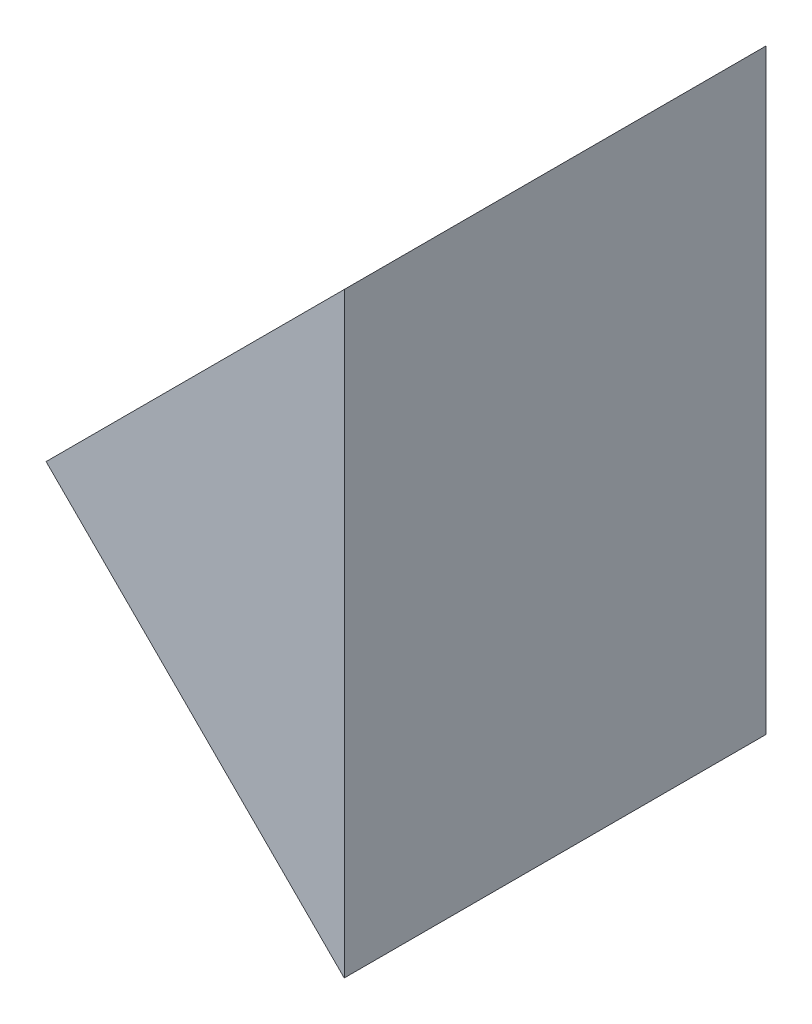
ISO-10303-21;
HEADER;
FILE_DESCRIPTION(('STEP AP214'),'2;1');
FILE_NAME('part.step','',(''),(''),'','','');
FILE_SCHEMA(('AUTOMOTIVE_DESIGN { 1 0 10303 214 1 1 1 1 }'));
ENDSEC;
DATA;
#1=APPLICATION_CONTEXT('core data for automotive mechanical design processes');
#2=APPLICATION_PROTOCOL_DEFINITION('international standard','automotive_design',2000,#1);
#3=PRODUCT_CONTEXT('',#1,'mechanical');
#4=PRODUCT('Part','Part','',(#3));
#5=PRODUCT_RELATED_PRODUCT_CATEGORY('part','',(#4));
#6=PRODUCT_DEFINITION_FORMATION('','',#4);
#7=PRODUCT_DEFINITION_CONTEXT('part definition',#1,'design');
#8=PRODUCT_DEFINITION('design','',#6,#7);
#9=PRODUCT_DEFINITION_SHAPE('','',#8);
#10=(LENGTH_UNIT() NAMED_UNIT(*) SI_UNIT(.MILLI.,.METRE.));
#11=(NAMED_UNIT(*) PLANE_ANGLE_UNIT() SI_UNIT($,.RADIAN.));
#12=(NAMED_UNIT(*) SI_UNIT($,.STERADIAN.) SOLID_ANGLE_UNIT());
#13=UNCERTAINTY_MEASURE_WITH_UNIT(LENGTH_MEASURE(1.E-05),#10,'distance_accuracy_value','');
#14=(GEOMETRIC_REPRESENTATION_CONTEXT(3) GLOBAL_UNCERTAINTY_ASSIGNED_CONTEXT((#13)) GLOBAL_UNIT_ASSIGNED_CONTEXT((#10,
#11,#12)) REPRESENTATION_CONTEXT('',''));
#15=CARTESIAN_POINT('',(0.,0.,0.));
#16=DIRECTION('',(0.,0.,1.));
#17=DIRECTION('',(1.,0.,0.));
#18=AXIS2_PLACEMENT_3D('',#15,#16,#17);
#19=CARTESIAN_POINT('',(277.383349762975,68.8784627641703,25.));
#20=DIRECTION('',(0.707106781186548,0.707106781186547,0.));
#21=DIRECTION('',(-0.707106781186547,0.707106781186548,0.));
#22=AXIS2_PLACEMENT_3D('',#19,#20,#21);
#23=PLANE('',#22);
#24=DIRECTION('',(0.707106781186547,-0.707106781186549,0.));
#25=VECTOR('',#24,1.);
#26=CARTESIAN_POINT('',(277.383349762975,68.8784627641703,0.));
#27=LINE('',#26,#25);
#28=CARTESIAN_POINT('',(277.383349762975,68.8784627641703,0.));
#29=VERTEX_POINT('',#28);
#30=CARTESIAN_POINT('',(295.061019292638,51.2007932345066,0.));
#31=VERTEX_POINT('',#30);
#32=EDGE_CURVE('E84',#29,#31,#27,.T.);
#33=ORIENTED_EDGE('',*,*,#32,.T.);
#34=DIRECTION('',(0.,0.,-1.));
#35=VECTOR('',#34,1.);
#36=CARTESIAN_POINT('',(295.061019292638,51.2007932345066,25.));
#37=LINE('',#36,#35);
#38=CARTESIAN_POINT('',(295.061019292638,51.2007932345066,25.));
#39=VERTEX_POINT('',#38);
#40=EDGE_CURVE('E11',#39,#31,#37,.T.);
#41=ORIENTED_EDGE('',*,*,#40,.F.);
#42=DIRECTION('',(0.707106781186547,-0.707106781186549,0.));
#43=VECTOR('',#42,1.);
#44=CARTESIAN_POINT('',(277.383349762975,68.8784627641703,25.));
#45=LINE('',#44,#43);
#46=CARTESIAN_POINT('',(277.383349762975,68.8784627641703,25.));
#47=VERTEX_POINT('',#46);
#48=EDGE_CURVE('E77',#47,#39,#45,.T.);
#49=ORIENTED_EDGE('',*,*,#48,.F.);
#50=DIRECTION('',(0.,0.,-1.));
#51=VECTOR('',#50,1.);
#52=CARTESIAN_POINT('',(277.383349762975,68.8784627641703,25.));
#53=LINE('',#52,#51);
#54=EDGE_CURVE('E85',#47,#29,#53,.T.);
#55=ORIENTED_EDGE('',*,*,#54,.T.);
#56=EDGE_LOOP('',(#33,#41,#49,#55));
#57=FACE_BOUND('',#56,.T.);
#58=ADVANCED_FACE('F37',(#57),#23,.F.);
#59=CARTESIAN_POINT('',(295.061019292638,51.2007932345066,25.));
#60=DIRECTION('',(-1.,0.,0.));
#61=DIRECTION('',(0.,-1.,0.));
#62=AXIS2_PLACEMENT_3D('',#59,#60,#61);
#63=PLANE('',#62);
#64=DIRECTION('',(0.,1.,0.));
#65=VECTOR('',#64,1.);
#66=CARTESIAN_POINT('',(295.061019292638,51.2007932345066,0.));
#67=LINE('',#66,#65);
#68=CARTESIAN_POINT('',(295.061019292638,86.556132293834,0.));
#69=VERTEX_POINT('',#68);
#70=EDGE_CURVE('E65',#31,#69,#67,.T.);
#71=ORIENTED_EDGE('',*,*,#70,.T.);
#72=DIRECTION('',(0.,0.,-1.));
#73=VECTOR('',#72,1.);
#74=CARTESIAN_POINT('',(295.061019292638,86.556132293834,25.));
#75=LINE('',#74,#73);
#76=CARTESIAN_POINT('',(295.061019292638,86.556132293834,25.));
#77=VERTEX_POINT('',#76);
#78=EDGE_CURVE('E45',#77,#69,#75,.T.);
#79=ORIENTED_EDGE('',*,*,#78,.F.);
#80=DIRECTION('',(0.,1.,0.));
#81=VECTOR('',#80,1.);
#82=CARTESIAN_POINT('',(295.061019292638,51.2007932345066,25.));
#83=LINE('',#82,#81);
#84=EDGE_CURVE('E73',#39,#77,#83,.T.);
#85=ORIENTED_EDGE('',*,*,#84,.F.);
#86=ORIENTED_EDGE('',*,*,#40,.T.);
#87=EDGE_LOOP('',(#71,#79,#85,#86));
#88=FACE_BOUND('',#87,.T.);
#89=ADVANCED_FACE('F74',(#88),#63,.F.);
#90=CARTESIAN_POINT('',(277.383349762975,68.8784627641703,25.));
#91=DIRECTION('',(0.707106781186547,-0.707106781186548,0.));
#92=DIRECTION('',(0.707106781186548,0.707106781186547,0.));
#93=AXIS2_PLACEMENT_3D('',#90,#91,#92);
#94=PLANE('',#93);
#95=DIRECTION('',(-0.707106781186548,-0.707106781186547,0.));
#96=VECTOR('',#95,1.);
#97=CARTESIAN_POINT('',(277.383349762975,68.8784627641703,0.));
#98=LINE('',#97,#96);
#99=EDGE_CURVE('E70',#69,#29,#98,.T.);
#100=ORIENTED_EDGE('',*,*,#99,.T.);
#101=ORIENTED_EDGE('',*,*,#54,.F.);
#102=DIRECTION('',(-0.707106781186548,-0.707106781186547,0.));
#103=VECTOR('',#102,1.);
#104=CARTESIAN_POINT('',(277.383349762975,68.8784627641703,25.));
#105=LINE('',#104,#103);
#106=EDGE_CURVE('E53',#77,#47,#105,.T.);
#107=ORIENTED_EDGE('',*,*,#106,.F.);
#108=ORIENTED_EDGE('',*,*,#78,.T.);
#109=EDGE_LOOP('',(#100,#101,#107,#108));
#110=FACE_BOUND('',#109,.T.);
#111=ADVANCED_FACE('F92',(#110),#94,.F.);
#112=CARTESIAN_POINT('',(0.,0.,25.));
#113=DIRECTION('',(0.,0.,1.));
#114=DIRECTION('',(1.,0.,0.));
#115=AXIS2_PLACEMENT_3D('',#112,#113,#114);
#116=PLANE('',#115);
#117=ORIENTED_EDGE('',*,*,#48,.T.);
#118=ORIENTED_EDGE('',*,*,#84,.T.);
#119=ORIENTED_EDGE('',*,*,#106,.T.);
#120=EDGE_LOOP('',(#117,#118,#119));
#121=FACE_BOUND('',#120,.T.);
#122=ADVANCED_FACE('F80',(#121),#116,.T.);
#123=CARTESIAN_POINT('',(0.,0.,0.));
#124=DIRECTION('',(0.,0.,1.));
#125=DIRECTION('',(1.,0.,0.));
#126=AXIS2_PLACEMENT_3D('',#123,#124,#125);
#127=PLANE('',#126);
#128=ORIENTED_EDGE('',*,*,#32,.F.);
#129=ORIENTED_EDGE('',*,*,#99,.F.);
#130=ORIENTED_EDGE('',*,*,#70,.F.);
#131=EDGE_LOOP('',(#128,#129,#130));
#132=FACE_BOUND('',#131,.T.);
#133=ADVANCED_FACE('F93',(#132),#127,.F.);
#134=CLOSED_SHELL('',(#58,#89,#111,#122,#133));
#135=MANIFOLD_SOLID_BREP('B2',#134);
#136=ADVANCED_BREP_SHAPE_REPRESENTATION('',(#18,#135),#14);
#137=SHAPE_DEFINITION_REPRESENTATION(#9,#136);
ENDSEC;
END-ISO-10303-21;
